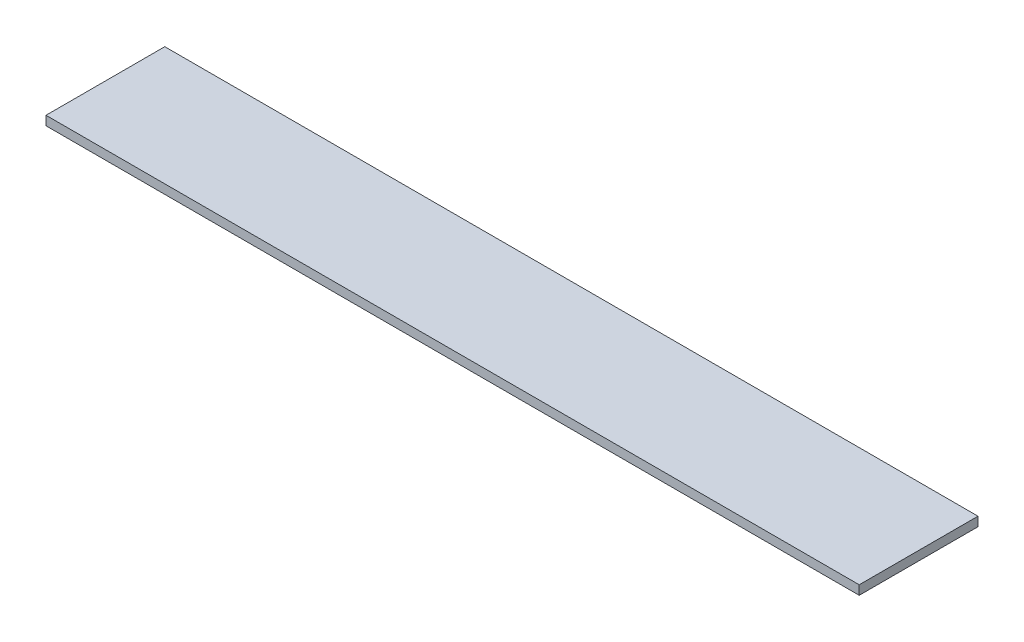
ISO-10303-21;
HEADER;
FILE_DESCRIPTION(('STEP AP214'),'2;1');
FILE_NAME('part.step','',(''),(''),'','','');
FILE_SCHEMA(('AUTOMOTIVE_DESIGN { 1 0 10303 214 1 1 1 1 }'));
ENDSEC;
DATA;
#1=APPLICATION_CONTEXT('core data for automotive mechanical design processes');
#2=APPLICATION_PROTOCOL_DEFINITION('international standard','automotive_design',2000,#1);
#3=PRODUCT_CONTEXT('',#1,'mechanical');
#4=PRODUCT('Part','Part','',(#3));
#5=PRODUCT_RELATED_PRODUCT_CATEGORY('part','',(#4));
#6=PRODUCT_DEFINITION_FORMATION('','',#4);
#7=PRODUCT_DEFINITION_CONTEXT('part definition',#1,'design');
#8=PRODUCT_DEFINITION('design','',#6,#7);
#9=PRODUCT_DEFINITION_SHAPE('','',#8);
#10=(LENGTH_UNIT() NAMED_UNIT(*) SI_UNIT(.MILLI.,.METRE.));
#11=(NAMED_UNIT(*) PLANE_ANGLE_UNIT() SI_UNIT($,.RADIAN.));
#12=(NAMED_UNIT(*) SI_UNIT($,.STERADIAN.) SOLID_ANGLE_UNIT());
#13=UNCERTAINTY_MEASURE_WITH_UNIT(LENGTH_MEASURE(1.E-05),#10,'distance_accuracy_value','');
#14=(GEOMETRIC_REPRESENTATION_CONTEXT(3) GLOBAL_UNCERTAINTY_ASSIGNED_CONTEXT((#13)) GLOBAL_UNIT_ASSIGNED_CONTEXT((#10,
#11,#12)) REPRESENTATION_CONTEXT('',''));
#15=CARTESIAN_POINT('',(0.,0.,0.));
#16=DIRECTION('',(0.,0.,1.));
#17=DIRECTION('',(1.,0.,0.));
#18=AXIS2_PLACEMENT_3D('',#15,#16,#17);
#19=CARTESIAN_POINT('',(0.,10.,0.));
#20=DIRECTION('',(1.,0.,0.));
#21=DIRECTION('',(0.,0.,-1.));
#22=AXIS2_PLACEMENT_3D('',#19,#20,#21);
#23=PLANE('',#22);
#24=DIRECTION('',(0.,0.,1.));
#25=VECTOR('',#24,1.);
#26=CARTESIAN_POINT('',(0.,0.,0.));
#27=LINE('',#26,#25);
#28=CARTESIAN_POINT('',(0.,0.,-130.));
#29=VERTEX_POINT('',#28);
#30=CARTESIAN_POINT('',(0.,0.,0.));
#31=VERTEX_POINT('',#30);
#32=EDGE_CURVE('E95',#29,#31,#27,.T.);
#33=ORIENTED_EDGE('',*,*,#32,.T.);
#34=DIRECTION('',(0.,-1.,0.));
#35=VECTOR('',#34,1.);
#36=CARTESIAN_POINT('',(0.,10.,0.));
#37=LINE('',#36,#35);
#38=CARTESIAN_POINT('',(0.,10.,0.));
#39=VERTEX_POINT('',#38);
#40=EDGE_CURVE('E11',#39,#31,#37,.T.);
#41=ORIENTED_EDGE('',*,*,#40,.F.);
#42=DIRECTION('',(0.,0.,1.));
#43=VECTOR('',#42,1.);
#44=CARTESIAN_POINT('',(0.,10.,0.));
#45=LINE('',#44,#43);
#46=CARTESIAN_POINT('',(0.,10.,-130.));
#47=VERTEX_POINT('',#46);
#48=EDGE_CURVE('E83',#47,#39,#45,.T.);
#49=ORIENTED_EDGE('',*,*,#48,.F.);
#50=DIRECTION('',(0.,-1.,0.));
#51=VECTOR('',#50,1.);
#52=CARTESIAN_POINT('',(0.,10.,-130.));
#53=LINE('',#52,#51);
#54=EDGE_CURVE('E91',#47,#29,#53,.T.);
#55=ORIENTED_EDGE('',*,*,#54,.T.);
#56=EDGE_LOOP('',(#33,#41,#49,#55));
#57=FACE_BOUND('',#56,.T.);
#58=ADVANCED_FACE('F32',(#57),#23,.F.);
#59=CARTESIAN_POINT('',(0.,10.,0.));
#60=DIRECTION('',(0.,0.,-1.));
#61=DIRECTION('',(-1.,0.,0.));
#62=AXIS2_PLACEMENT_3D('',#59,#60,#61);
#63=PLANE('',#62);
#64=DIRECTION('',(1.,0.,0.));
#65=VECTOR('',#64,1.);
#66=CARTESIAN_POINT('',(0.,0.,0.));
#67=LINE('',#66,#65);
#68=CARTESIAN_POINT('',(890.,0.,0.));
#69=VERTEX_POINT('',#68);
#70=EDGE_CURVE('E87',#31,#69,#67,.T.);
#71=ORIENTED_EDGE('',*,*,#70,.T.);
#72=DIRECTION('',(0.,-1.,0.));
#73=VECTOR('',#72,1.);
#74=CARTESIAN_POINT('',(890.,10.,0.));
#75=LINE('',#74,#73);
#76=CARTESIAN_POINT('',(890.,10.,0.));
#77=VERTEX_POINT('',#76);
#78=EDGE_CURVE('E40',#77,#69,#75,.T.);
#79=ORIENTED_EDGE('',*,*,#78,.F.);
#80=DIRECTION('',(1.,0.,0.));
#81=VECTOR('',#80,1.);
#82=CARTESIAN_POINT('',(0.,10.,0.));
#83=LINE('',#82,#81);
#84=EDGE_CURVE('E78',#39,#77,#83,.T.);
#85=ORIENTED_EDGE('',*,*,#84,.F.);
#86=ORIENTED_EDGE('',*,*,#40,.T.);
#87=EDGE_LOOP('',(#71,#79,#85,#86));
#88=FACE_BOUND('',#87,.T.);
#89=ADVANCED_FACE('F86',(#88),#63,.F.);
#90=CARTESIAN_POINT('',(890.,10.,0.));
#91=DIRECTION('',(-1.,0.,0.));
#92=DIRECTION('',(0.,0.,1.));
#93=AXIS2_PLACEMENT_3D('',#90,#91,#92);
#94=PLANE('',#93);
#95=DIRECTION('',(0.,0.,-1.));
#96=VECTOR('',#95,1.);
#97=CARTESIAN_POINT('',(890.,0.,0.));
#98=LINE('',#97,#96);
#99=CARTESIAN_POINT('',(890.,0.,-130.));
#100=VERTEX_POINT('',#99);
#101=EDGE_CURVE('E65',#69,#100,#98,.T.);
#102=ORIENTED_EDGE('',*,*,#101,.T.);
#103=DIRECTION('',(0.,-1.,0.));
#104=VECTOR('',#103,1.);
#105=CARTESIAN_POINT('',(890.,10.,-130.));
#106=LINE('',#105,#104);
#107=CARTESIAN_POINT('',(890.,10.,-130.));
#108=VERTEX_POINT('',#107);
#109=EDGE_CURVE('E88',#108,#100,#106,.T.);
#110=ORIENTED_EDGE('',*,*,#109,.F.);
#111=DIRECTION('',(0.,0.,-1.));
#112=VECTOR('',#111,1.);
#113=CARTESIAN_POINT('',(890.,10.,0.));
#114=LINE('',#113,#112);
#115=EDGE_CURVE('E81',#77,#108,#114,.T.);
#116=ORIENTED_EDGE('',*,*,#115,.F.);
#117=ORIENTED_EDGE('',*,*,#78,.T.);
#118=EDGE_LOOP('',(#102,#110,#116,#117));
#119=FACE_BOUND('',#118,.T.);
#120=ADVANCED_FACE('F89',(#119),#94,.F.);
#121=CARTESIAN_POINT('',(0.,10.,-130.));
#122=DIRECTION('',(0.,0.,1.));
#123=DIRECTION('',(1.,0.,0.));
#124=AXIS2_PLACEMENT_3D('',#121,#122,#123);
#125=PLANE('',#124);
#126=DIRECTION('',(-1.,0.,0.));
#127=VECTOR('',#126,1.);
#128=CARTESIAN_POINT('',(0.,0.,-130.));
#129=LINE('',#128,#127);
#130=EDGE_CURVE('E71',#100,#29,#129,.T.);
#131=ORIENTED_EDGE('',*,*,#130,.T.);
#132=ORIENTED_EDGE('',*,*,#54,.F.);
#133=DIRECTION('',(-1.,0.,0.));
#134=VECTOR('',#133,1.);
#135=CARTESIAN_POINT('',(0.,10.,-130.));
#136=LINE('',#135,#134);
#137=EDGE_CURVE('E48',#108,#47,#136,.T.);
#138=ORIENTED_EDGE('',*,*,#137,.F.);
#139=ORIENTED_EDGE('',*,*,#109,.T.);
#140=EDGE_LOOP('',(#131,#132,#138,#139));
#141=FACE_BOUND('',#140,.T.);
#142=ADVANCED_FACE('F102',(#141),#125,.F.);
#143=CARTESIAN_POINT('',(0.,10.,0.));
#144=DIRECTION('',(0.,-1.,0.));
#145=DIRECTION('',(0.,0.,-1.));
#146=AXIS2_PLACEMENT_3D('',#143,#144,#145);
#147=PLANE('',#146);
#148=ORIENTED_EDGE('',*,*,#48,.T.);
#149=ORIENTED_EDGE('',*,*,#84,.T.);
#150=ORIENTED_EDGE('',*,*,#115,.T.);
#151=ORIENTED_EDGE('',*,*,#137,.T.);
#152=EDGE_LOOP('',(#148,#149,#150,#151));
#153=FACE_BOUND('',#152,.T.);
#154=ADVANCED_FACE('F79',(#153),#147,.F.);
#155=CARTESIAN_POINT('',(0.,0.,0.));
#156=DIRECTION('',(0.,-1.,0.));
#157=DIRECTION('',(0.,0.,-1.));
#158=AXIS2_PLACEMENT_3D('',#155,#156,#157);
#159=PLANE('',#158);
#160=ORIENTED_EDGE('',*,*,#32,.F.);
#161=ORIENTED_EDGE('',*,*,#130,.F.);
#162=ORIENTED_EDGE('',*,*,#101,.F.);
#163=ORIENTED_EDGE('',*,*,#70,.F.);
#164=EDGE_LOOP('',(#160,#161,#162,#163));
#165=FACE_BOUND('',#164,.T.);
#166=ADVANCED_FACE('F105',(#165),#159,.T.);
#167=CLOSED_SHELL('',(#58,#89,#120,#142,#154,#166));
#168=MANIFOLD_SOLID_BREP('B2',#167);
#169=ADVANCED_BREP_SHAPE_REPRESENTATION('',(#18,#168),#14);
#170=SHAPE_DEFINITION_REPRESENTATION(#9,#169);
ENDSEC;
END-ISO-10303-21;
